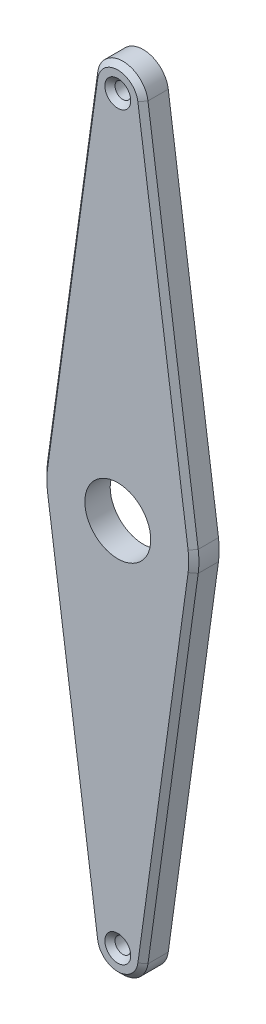
ISO-10303-21;
HEADER;
FILE_DESCRIPTION(('STEP AP214'),'2;1');
FILE_NAME('part.step','',(''),(''),'','','');
FILE_SCHEMA(('AUTOMOTIVE_DESIGN { 1 0 10303 214 1 1 1 1 }'));
ENDSEC;
DATA;
#1=APPLICATION_CONTEXT('core data for automotive mechanical design processes');
#2=APPLICATION_PROTOCOL_DEFINITION('international standard','automotive_design',2000,#1);
#3=PRODUCT_CONTEXT('',#1,'mechanical');
#4=PRODUCT('Part','Part','',(#3));
#5=PRODUCT_RELATED_PRODUCT_CATEGORY('part','',(#4));
#6=PRODUCT_DEFINITION_FORMATION('','',#4);
#7=PRODUCT_DEFINITION_CONTEXT('part definition',#1,'design');
#8=PRODUCT_DEFINITION('design','',#6,#7);
#9=PRODUCT_DEFINITION_SHAPE('','',#8);
#10=(LENGTH_UNIT() NAMED_UNIT(*) SI_UNIT(.MILLI.,.METRE.));
#11=(NAMED_UNIT(*) PLANE_ANGLE_UNIT() SI_UNIT($,.RADIAN.));
#12=(NAMED_UNIT(*) SI_UNIT($,.STERADIAN.) SOLID_ANGLE_UNIT());
#13=UNCERTAINTY_MEASURE_WITH_UNIT(LENGTH_MEASURE(1.E-05),#10,'distance_accuracy_value','');
#14=(GEOMETRIC_REPRESENTATION_CONTEXT(3) GLOBAL_UNCERTAINTY_ASSIGNED_CONTEXT((#13)) GLOBAL_UNIT_ASSIGNED_CONTEXT((#10,
#11,#12)) REPRESENTATION_CONTEXT('',''));
#15=CARTESIAN_POINT('',(0.,0.,0.));
#16=DIRECTION('',(0.,0.,1.));
#17=DIRECTION('',(1.,0.,0.));
#18=AXIS2_PLACEMENT_3D('',#15,#16,#17);
#19=CARTESIAN_POINT('',(0.,0.,5.));
#20=DIRECTION('',(0.,0.,1.));
#21=DIRECTION('',(1.,0.,0.));
#22=AXIS2_PLACEMENT_3D('',#19,#20,#21);
#23=PLANE('',#22);
#24=CARTESIAN_POINT('',(85.,68.,5.));
#25=DIRECTION('',(0.,0.,1.));
#26=DIRECTION('',(1.,0.,0.));
#27=AXIS2_PLACEMENT_3D('',#24,#25,#26);
#28=CIRCLE('',#27,6.5);
#29=CARTESIAN_POINT('',(91.5,68.,5.));
#30=VERTEX_POINT('',#29);
#31=EDGE_CURVE('E344',#30,#30,#28,.F.);
#32=ORIENTED_EDGE('',*,*,#31,.T.);
#33=EDGE_LOOP('',(#32));
#34=FACE_BOUND('',#33,.T.);
#35=CARTESIAN_POINT('',(85.,-5.,5.));
#36=DIRECTION('',(0.,0.,1.));
#37=DIRECTION('',(1.,0.,0.));
#38=AXIS2_PLACEMENT_3D('',#35,#36,#37);
#39=CIRCLE('',#38,2.55000000000002);
#40=CARTESIAN_POINT('',(87.55,-5.,5.));
#41=VERTEX_POINT('',#40);
#42=EDGE_CURVE('E43',#41,#41,#39,.F.);
#43=ORIENTED_EDGE('',*,*,#42,.T.);
#44=EDGE_LOOP('',(#43));
#45=FACE_BOUND('',#44,.T.);
#46=CARTESIAN_POINT('',(85.,68.,5.));
#47=DIRECTION('',(0.,0.,1.));
#48=DIRECTION('',(1.,0.,0.));
#49=AXIS2_PLACEMENT_3D('',#46,#47,#48);
#50=CIRCLE('',#49,14.);
#51=CARTESIAN_POINT('',(71.1319788133111,69.9178082191781,5.));
#52=VERTEX_POINT('',#51);
#53=CARTESIAN_POINT('',(71.1319788133111,66.0821917808219,5.));
#54=VERTEX_POINT('',#53);
#55=EDGE_CURVE('E197',#52,#54,#50,.T.);
#56=ORIENTED_EDGE('',*,*,#55,.T.);
#57=DIRECTION('',(0.136986301369863,-0.990572941906352,0.));
#58=VECTOR('',#57,1.);
#59=CARTESIAN_POINT('',(78.764187639776,10.8922970623549,5.));
#60=LINE('',#59,#58);
#61=CARTESIAN_POINT('',(81.0377082323746,-5.54794520547945,5.));
#62=VERTEX_POINT('',#61);
#63=EDGE_CURVE('E199',#54,#62,#60,.T.);
#64=ORIENTED_EDGE('',*,*,#63,.T.);
#65=CARTESIAN_POINT('',(85.,-5.,5.));
#66=DIRECTION('',(0.,0.,1.));
#67=DIRECTION('',(1.,0.,0.));
#68=AXIS2_PLACEMENT_3D('',#65,#66,#67);
#69=CIRCLE('',#68,3.99999999999996);
#70=CARTESIAN_POINT('',(88.9622917676253,-5.54794520547945,5.));
#71=VERTEX_POINT('',#70);
#72=EDGE_CURVE('E185',#62,#71,#69,.T.);
#73=ORIENTED_EDGE('',*,*,#72,.T.);
#74=DIRECTION('',(0.136986301369863,0.990572941906352,0.));
#75=VECTOR('',#74,1.);
#76=CARTESIAN_POINT('',(98.8680211866889,66.0821917808219,5.));
#77=LINE('',#76,#75);
#78=CARTESIAN_POINT('',(98.8680211866889,66.0821917808219,5.));
#79=VERTEX_POINT('',#78);
#80=EDGE_CURVE('E187',#71,#79,#77,.T.);
#81=ORIENTED_EDGE('',*,*,#80,.T.);
#82=CARTESIAN_POINT('',(85.,68.,5.));
#83=DIRECTION('',(0.,0.,1.));
#84=DIRECTION('',(1.,0.,0.));
#85=AXIS2_PLACEMENT_3D('',#82,#83,#84);
#86=CIRCLE('',#85,14.);
#87=CARTESIAN_POINT('',(98.8680211866889,69.9178082191781,5.));
#88=VERTEX_POINT('',#87);
#89=EDGE_CURVE('E189',#79,#88,#86,.T.);
#90=ORIENTED_EDGE('',*,*,#89,.T.);
#91=DIRECTION('',(-0.136986301369863,0.990572941906352,0.));
#92=VECTOR('',#91,1.);
#93=CARTESIAN_POINT('',(106.500230013154,14.727913500711,5.));
#94=LINE('',#93,#92);
#95=CARTESIAN_POINT('',(88.9622917676254,141.547945205479,5.));
#96=VERTEX_POINT('',#95);
#97=EDGE_CURVE('E191',#88,#96,#94,.T.);
#98=ORIENTED_EDGE('',*,*,#97,.T.);
#99=CARTESIAN_POINT('',(85.,141.,5.));
#100=DIRECTION('',(0.,0.,1.));
#101=DIRECTION('',(1.,0.,0.));
#102=AXIS2_PLACEMENT_3D('',#99,#100,#101);
#103=CIRCLE('',#102,3.99999999999996);
#104=CARTESIAN_POINT('',(81.0377082323746,141.547945205479,5.));
#105=VERTEX_POINT('',#104);
#106=EDGE_CURVE('E193',#96,#105,#103,.T.);
#107=ORIENTED_EDGE('',*,*,#106,.T.);
#108=DIRECTION('',(-0.136986301369863,-0.990572941906352,0.));
#109=VECTOR('',#108,1.);
#110=CARTESIAN_POINT('',(71.1319788133111,69.9178082191781,5.));
#111=LINE('',#110,#109);
#112=EDGE_CURVE('E195',#105,#52,#111,.T.);
#113=ORIENTED_EDGE('',*,*,#112,.T.);
#114=EDGE_LOOP('',(#56,#64,#73,#81,#90,#98,#107,#113));
#115=FACE_BOUND('',#114,.T.);
#116=CARTESIAN_POINT('',(85.,141.,5.));
#117=DIRECTION('',(0.,0.,1.));
#118=DIRECTION('',(1.,0.,0.));
#119=AXIS2_PLACEMENT_3D('',#116,#117,#118);
#120=CIRCLE('',#119,2.55000000000004);
#121=CARTESIAN_POINT('',(87.55,141.,5.));
#122=VERTEX_POINT('',#121);
#123=EDGE_CURVE('E235',#122,#122,#120,.F.);
#124=ORIENTED_EDGE('',*,*,#123,.T.);
#125=EDGE_LOOP('',(#124));
#126=FACE_BOUND('',#125,.T.);
#127=ADVANCED_FACE('F35',(#34,#45,#115,#126),#23,.T.);
#128=CARTESIAN_POINT('',(0.,0.,0.));
#129=DIRECTION('',(0.,0.,1.));
#130=DIRECTION('',(1.,0.,0.));
#131=AXIS2_PLACEMENT_3D('',#128,#129,#130);
#132=PLANE('',#131);
#133=CARTESIAN_POINT('',(85.,68.,0.));
#134=DIRECTION('',(0.,0.,-1.));
#135=DIRECTION('',(-1.,0.,0.));
#136=AXIS2_PLACEMENT_3D('',#133,#134,#135);
#137=CIRCLE('',#136,6.5);
#138=CARTESIAN_POINT('',(78.5,68.,0.));
#139=VERTEX_POINT('',#138);
#140=EDGE_CURVE('E340',#139,#139,#137,.T.);
#141=ORIENTED_EDGE('',*,*,#140,.F.);
#142=EDGE_LOOP('',(#141));
#143=FACE_BOUND('',#142,.T.);
#144=CARTESIAN_POINT('',(85.,-5.,0.));
#145=DIRECTION('',(0.,0.,1.));
#146=DIRECTION('',(1.,0.,0.));
#147=AXIS2_PLACEMENT_3D('',#144,#145,#146);
#148=CIRCLE('',#147,4.99999999999999);
#149=CARTESIAN_POINT('',(89.9528647095317,-5.68493150684932,0.));
#150=VERTEX_POINT('',#149);
#151=CARTESIAN_POINT('',(80.0471352904682,-5.68493150684932,0.));
#152=VERTEX_POINT('',#151);
#153=EDGE_CURVE('E139',#150,#152,#148,.F.);
#154=ORIENTED_EDGE('',*,*,#153,.T.);
#155=DIRECTION('',(-0.136986301369863,0.990572941906352,0.));
#156=VECTOR('',#155,1.);
#157=CARTESIAN_POINT('',(77.7736146978696,10.755310760985,0.));
#158=LINE('',#157,#156);
#159=CARTESIAN_POINT('',(70.1414058714047,65.9452054794521,0.));
#160=VERTEX_POINT('',#159);
#161=EDGE_CURVE('E169',#152,#160,#158,.T.);
#162=ORIENTED_EDGE('',*,*,#161,.T.);
#163=CARTESIAN_POINT('',(85.,68.,0.));
#164=DIRECTION('',(0.,0.,1.));
#165=DIRECTION('',(1.,0.,0.));
#166=AXIS2_PLACEMENT_3D('',#163,#164,#165);
#167=CIRCLE('',#166,15.);
#168=CARTESIAN_POINT('',(70.1414058714047,70.054794520548,0.));
#169=VERTEX_POINT('',#168);
#170=EDGE_CURVE('E166',#169,#160,#167,.T.);
#171=ORIENTED_EDGE('',*,*,#170,.F.);
#172=DIRECTION('',(-0.136986301369863,-0.990572941906352,0.));
#173=VECTOR('',#172,1.);
#174=CARTESIAN_POINT('',(59.3191050952307,-8.2032372012177,0.));
#175=LINE('',#174,#173);
#176=CARTESIAN_POINT('',(80.0471352904682,141.684931506849,0.));
#177=VERTEX_POINT('',#176);
#178=EDGE_CURVE('E163',#177,#169,#175,.T.);
#179=ORIENTED_EDGE('',*,*,#178,.F.);
#180=CARTESIAN_POINT('',(85.,141.,0.));
#181=DIRECTION('',(0.,0.,1.));
#182=DIRECTION('',(1.,0.,0.));
#183=AXIS2_PLACEMENT_3D('',#180,#181,#182);
#184=CIRCLE('',#183,4.99999999999999);
#185=CARTESIAN_POINT('',(89.9528647095317,141.684931506849,0.));
#186=VERTEX_POINT('',#185);
#187=EDGE_CURVE('E160',#186,#177,#184,.T.);
#188=ORIENTED_EDGE('',*,*,#187,.F.);
#189=DIRECTION('',(0.136986301369863,-0.990572941906352,0.));
#190=VECTOR('',#189,1.);
#191=CARTESIAN_POINT('',(107.49080295506,14.8648998020809,0.));
#192=LINE('',#191,#190);
#193=CARTESIAN_POINT('',(99.8585941285953,70.0547945205479,0.));
#194=VERTEX_POINT('',#193);
#195=EDGE_CURVE('E158',#186,#194,#192,.T.);
#196=ORIENTED_EDGE('',*,*,#195,.T.);
#197=CARTESIAN_POINT('',(85.,68.,0.));
#198=DIRECTION('',(0.,0.,1.));
#199=DIRECTION('',(1.,0.,0.));
#200=AXIS2_PLACEMENT_3D('',#197,#198,#199);
#201=CIRCLE('',#200,15.);
#202=CARTESIAN_POINT('',(99.8585941285952,65.9452054794521,0.));
#203=VERTEX_POINT('',#202);
#204=EDGE_CURVE('E143',#203,#194,#201,.T.);
#205=ORIENTED_EDGE('',*,*,#204,.F.);
#206=DIRECTION('',(0.136986301369863,0.990572941906352,0.));
#207=VECTOR('',#206,1.);
#208=CARTESIAN_POINT('',(89.0362933524212,-12.3128262423136,0.));
#209=LINE('',#208,#207);
#210=EDGE_CURVE('E126',#150,#203,#209,.T.);
#211=ORIENTED_EDGE('',*,*,#210,.F.);
#212=EDGE_LOOP('',(#154,#162,#171,#179,#188,#196,#205,#211));
#213=FACE_BOUND('',#212,.T.);
#214=CARTESIAN_POINT('',(85.,141.,0.));
#215=DIRECTION('',(0.,0.,1.));
#216=DIRECTION('',(1.,0.,0.));
#217=AXIS2_PLACEMENT_3D('',#214,#215,#216);
#218=CIRCLE('',#217,1.55000000000001);
#219=CARTESIAN_POINT('',(86.55,141.,0.));
#220=VERTEX_POINT('',#219);
#221=EDGE_CURVE('E154',#220,#220,#218,.F.);
#222=ORIENTED_EDGE('',*,*,#221,.F.);
#223=EDGE_LOOP('',(#222));
#224=FACE_BOUND('',#223,.T.);
#225=CARTESIAN_POINT('',(85.,-5.,0.));
#226=DIRECTION('',(0.,0.,1.));
#227=DIRECTION('',(1.,0.,0.));
#228=AXIS2_PLACEMENT_3D('',#225,#226,#227);
#229=CIRCLE('',#228,1.55000000000001);
#230=CARTESIAN_POINT('',(86.55,-5.,0.));
#231=VERTEX_POINT('',#230);
#232=EDGE_CURVE('E338',#231,#231,#229,.T.);
#233=ORIENTED_EDGE('',*,*,#232,.T.);
#234=EDGE_LOOP('',(#233));
#235=FACE_BOUND('',#234,.T.);
#236=ADVANCED_FACE('F136',(#143,#213,#224,#235),#132,.F.);
#237=CARTESIAN_POINT('',(85.,-5.,5.));
#238=DIRECTION('',(0.,0.,-1.));
#239=DIRECTION('',(-1.,0.,0.));
#240=AXIS2_PLACEMENT_3D('',#237,#238,#239);
#241=CYLINDRICAL_SURFACE('',#240,4.99999999999999);
#242=DIRECTION('',(0.,0.,-1.));
#243=VECTOR('',#242,1.);
#244=CARTESIAN_POINT('',(89.9528647095317,-5.68493150684932,5.));
#245=LINE('',#244,#243);
#246=CARTESIAN_POINT('',(89.9528647095317,-5.68493150684932,3.99999999999997));
#247=VERTEX_POINT('',#246);
#248=EDGE_CURVE('E123',#247,#150,#245,.T.);
#249=ORIENTED_EDGE('',*,*,#248,.F.);
#250=CARTESIAN_POINT('',(85.,-5.,3.99999999999997));
#251=DIRECTION('',(0.,0.,1.));
#252=DIRECTION('',(1.,0.,0.));
#253=AXIS2_PLACEMENT_3D('',#250,#251,#252);
#254=CIRCLE('',#253,4.99999999999999);
#255=CARTESIAN_POINT('',(80.0471352904682,-5.68493150684932,3.99999999999997));
#256=VERTEX_POINT('',#255);
#257=EDGE_CURVE('E212',#247,#256,#254,.F.);
#258=ORIENTED_EDGE('',*,*,#257,.T.);
#259=DIRECTION('',(0.,0.,-1.));
#260=VECTOR('',#259,1.);
#261=CARTESIAN_POINT('',(80.0471352904682,-5.68493150684932,5.));
#262=LINE('',#261,#260);
#263=EDGE_CURVE('E147',#256,#152,#262,.T.);
#264=ORIENTED_EDGE('',*,*,#263,.T.);
#265=ORIENTED_EDGE('',*,*,#153,.F.);
#266=EDGE_LOOP('',(#249,#258,#264,#265));
#267=FACE_BOUND('',#266,.T.);
#268=ADVANCED_FACE('F145',(#267),#241,.T.);
#269=CARTESIAN_POINT('',(89.0362933524212,-12.3128262423136,5.));
#270=DIRECTION('',(-0.990572941906352,0.136986301369863,0.));
#271=DIRECTION('',(-0.136986301369863,-0.990572941906352,0.));
#272=AXIS2_PLACEMENT_3D('',#269,#270,#271);
#273=PLANE('',#272);
#274=DIRECTION('',(0.,0.,-1.));
#275=VECTOR('',#274,1.);
#276=CARTESIAN_POINT('',(99.8585941285952,65.9452054794521,5.));
#277=LINE('',#276,#275);
#278=CARTESIAN_POINT('',(99.8585941285952,65.9452054794521,3.99999999999997));
#279=VERTEX_POINT('',#278);
#280=EDGE_CURVE('E132',#279,#203,#277,.T.);
#281=ORIENTED_EDGE('',*,*,#280,.F.);
#282=DIRECTION('',(-0.136986301369863,-0.990572941906352,0.));
#283=VECTOR('',#282,1.);
#284=CARTESIAN_POINT('',(89.9528647095317,-5.68493150684932,3.99999999999997));
#285=LINE('',#284,#283);
#286=EDGE_CURVE('E50',#279,#247,#285,.T.);
#287=ORIENTED_EDGE('',*,*,#286,.T.);
#288=ORIENTED_EDGE('',*,*,#248,.T.);
#289=ORIENTED_EDGE('',*,*,#210,.T.);
#290=EDGE_LOOP('',(#281,#287,#288,#289));
#291=FACE_BOUND('',#290,.T.);
#292=ADVANCED_FACE('F125',(#291),#273,.F.);
#293=CARTESIAN_POINT('',(85.,68.,5.));
#294=DIRECTION('',(0.,0.,-1.));
#295=DIRECTION('',(-1.,0.,0.));
#296=AXIS2_PLACEMENT_3D('',#293,#294,#295);
#297=CYLINDRICAL_SURFACE('',#296,15.);
#298=DIRECTION('',(0.,0.,-1.));
#299=VECTOR('',#298,1.);
#300=CARTESIAN_POINT('',(99.8585941285953,70.0547945205479,5.));
#301=LINE('',#300,#299);
#302=CARTESIAN_POINT('',(99.8585941285953,70.0547945205479,3.99999999999997));
#303=VERTEX_POINT('',#302);
#304=EDGE_CURVE('E180',#303,#194,#301,.T.);
#305=ORIENTED_EDGE('',*,*,#304,.F.);
#306=CARTESIAN_POINT('',(85.,68.,3.99999999999997));
#307=DIRECTION('',(0.,0.,1.));
#308=DIRECTION('',(1.,0.,0.));
#309=AXIS2_PLACEMENT_3D('',#306,#307,#308);
#310=CIRCLE('',#309,15.);
#311=EDGE_CURVE('E58',#303,#279,#310,.F.);
#312=ORIENTED_EDGE('',*,*,#311,.T.);
#313=ORIENTED_EDGE('',*,*,#280,.T.);
#314=ORIENTED_EDGE('',*,*,#204,.T.);
#315=EDGE_LOOP('',(#305,#312,#313,#314));
#316=FACE_BOUND('',#315,.T.);
#317=ADVANCED_FACE('F288',(#316),#297,.T.);
#318=CARTESIAN_POINT('',(107.49080295506,14.8648998020809,5.));
#319=DIRECTION('',(0.990572941906352,0.136986301369863,0.));
#320=DIRECTION('',(-0.136986301369863,0.990572941906352,0.));
#321=AXIS2_PLACEMENT_3D('',#318,#319,#320);
#322=PLANE('',#321);
#323=DIRECTION('',(0.,0.,-1.));
#324=VECTOR('',#323,1.);
#325=CARTESIAN_POINT('',(89.9528647095317,141.684931506849,5.));
#326=LINE('',#325,#324);
#327=CARTESIAN_POINT('',(89.9528647095317,141.684931506849,3.99999999999997));
#328=VERTEX_POINT('',#327);
#329=EDGE_CURVE('E178',#328,#186,#326,.T.);
#330=ORIENTED_EDGE('',*,*,#329,.F.);
#331=DIRECTION('',(0.136986301369863,-0.990572941906352,0.));
#332=VECTOR('',#331,1.);
#333=CARTESIAN_POINT('',(107.49080295506,14.8648998020809,3.99999999999997));
#334=LINE('',#333,#332);
#335=EDGE_CURVE('E208',#328,#303,#334,.T.);
#336=ORIENTED_EDGE('',*,*,#335,.T.);
#337=ORIENTED_EDGE('',*,*,#304,.T.);
#338=ORIENTED_EDGE('',*,*,#195,.F.);
#339=EDGE_LOOP('',(#330,#336,#337,#338));
#340=FACE_BOUND('',#339,.T.);
#341=ADVANCED_FACE('F284',(#340),#322,.T.);
#342=CARTESIAN_POINT('',(85.,141.,5.));
#343=DIRECTION('',(0.,0.,-1.));
#344=DIRECTION('',(-1.,0.,0.));
#345=AXIS2_PLACEMENT_3D('',#342,#343,#344);
#346=CYLINDRICAL_SURFACE('',#345,4.99999999999999);
#347=DIRECTION('',(0.,0.,-1.));
#348=VECTOR('',#347,1.);
#349=CARTESIAN_POINT('',(80.0471352904682,141.684931506849,5.));
#350=LINE('',#349,#348);
#351=CARTESIAN_POINT('',(80.0471352904682,141.684931506849,3.99999999999997));
#352=VERTEX_POINT('',#351);
#353=EDGE_CURVE('E176',#352,#177,#350,.T.);
#354=ORIENTED_EDGE('',*,*,#353,.F.);
#355=CARTESIAN_POINT('',(85.,141.,3.99999999999997));
#356=DIRECTION('',(0.,0.,1.));
#357=DIRECTION('',(1.,0.,0.));
#358=AXIS2_PLACEMENT_3D('',#355,#356,#357);
#359=CIRCLE('',#358,4.99999999999999);
#360=EDGE_CURVE('E206',#352,#328,#359,.F.);
#361=ORIENTED_EDGE('',*,*,#360,.T.);
#362=ORIENTED_EDGE('',*,*,#329,.T.);
#363=ORIENTED_EDGE('',*,*,#187,.T.);
#364=EDGE_LOOP('',(#354,#361,#362,#363));
#365=FACE_BOUND('',#364,.T.);
#366=ADVANCED_FACE('F280',(#365),#346,.T.);
#367=CARTESIAN_POINT('',(59.3191050952307,-8.2032372012177,5.));
#368=DIRECTION('',(0.990572941906352,-0.136986301369863,0.));
#369=DIRECTION('',(0.136986301369863,0.990572941906352,0.));
#370=AXIS2_PLACEMENT_3D('',#367,#368,#369);
#371=PLANE('',#370);
#372=DIRECTION('',(0.,0.,-1.));
#373=VECTOR('',#372,1.);
#374=CARTESIAN_POINT('',(70.1414058714047,70.054794520548,5.));
#375=LINE('',#374,#373);
#376=CARTESIAN_POINT('',(70.1414058714047,70.054794520548,3.99999999999997));
#377=VERTEX_POINT('',#376);
#378=EDGE_CURVE('E174',#377,#169,#375,.T.);
#379=ORIENTED_EDGE('',*,*,#378,.F.);
#380=DIRECTION('',(0.136986301369863,0.990572941906352,0.));
#381=VECTOR('',#380,1.);
#382=CARTESIAN_POINT('',(80.0471352904682,141.684931506849,3.99999999999997));
#383=LINE('',#382,#381);
#384=EDGE_CURVE('E204',#377,#352,#383,.T.);
#385=ORIENTED_EDGE('',*,*,#384,.T.);
#386=ORIENTED_EDGE('',*,*,#353,.T.);
#387=ORIENTED_EDGE('',*,*,#178,.T.);
#388=EDGE_LOOP('',(#379,#385,#386,#387));
#389=FACE_BOUND('',#388,.T.);
#390=ADVANCED_FACE('F276',(#389),#371,.F.);
#391=CARTESIAN_POINT('',(85.,68.,5.));
#392=DIRECTION('',(0.,0.,-1.));
#393=DIRECTION('',(-1.,0.,0.));
#394=AXIS2_PLACEMENT_3D('',#391,#392,#393);
#395=CYLINDRICAL_SURFACE('',#394,15.);
#396=DIRECTION('',(0.,0.,-1.));
#397=VECTOR('',#396,1.);
#398=CARTESIAN_POINT('',(70.1414058714047,65.9452054794521,5.));
#399=LINE('',#398,#397);
#400=CARTESIAN_POINT('',(70.1414058714047,65.9452054794521,3.99999999999997));
#401=VERTEX_POINT('',#400);
#402=EDGE_CURVE('E172',#401,#160,#399,.T.);
#403=ORIENTED_EDGE('',*,*,#402,.F.);
#404=CARTESIAN_POINT('',(85.,68.,3.99999999999997));
#405=DIRECTION('',(0.,0.,1.));
#406=DIRECTION('',(1.,0.,0.));
#407=AXIS2_PLACEMENT_3D('',#404,#405,#406);
#408=CIRCLE('',#407,15.);
#409=EDGE_CURVE('E202',#401,#377,#408,.F.);
#410=ORIENTED_EDGE('',*,*,#409,.T.);
#411=ORIENTED_EDGE('',*,*,#378,.T.);
#412=ORIENTED_EDGE('',*,*,#170,.T.);
#413=EDGE_LOOP('',(#403,#410,#411,#412));
#414=FACE_BOUND('',#413,.T.);
#415=ADVANCED_FACE('F272',(#414),#395,.T.);
#416=CARTESIAN_POINT('',(77.7736146978696,10.755310760985,5.));
#417=DIRECTION('',(-0.990572941906352,-0.136986301369863,0.));
#418=DIRECTION('',(0.136986301369863,-0.990572941906352,0.));
#419=AXIS2_PLACEMENT_3D('',#416,#417,#418);
#420=PLANE('',#419);
#421=ORIENTED_EDGE('',*,*,#263,.F.);
#422=DIRECTION('',(-0.136986301369863,0.990572941906352,0.));
#423=VECTOR('',#422,1.);
#424=CARTESIAN_POINT('',(77.7736146978696,10.755310760985,3.99999999999998));
#425=LINE('',#424,#423);
#426=EDGE_CURVE('E131',#256,#401,#425,.T.);
#427=ORIENTED_EDGE('',*,*,#426,.T.);
#428=ORIENTED_EDGE('',*,*,#402,.T.);
#429=ORIENTED_EDGE('',*,*,#161,.F.);
#430=EDGE_LOOP('',(#421,#427,#428,#429));
#431=FACE_BOUND('',#430,.T.);
#432=ADVANCED_FACE('F268',(#431),#420,.T.);
#433=CARTESIAN_POINT('',(107.49080295506,14.8648998020809,3.99999999999997));
#434=DIRECTION('',(-0.700440844481893,-0.0968639426282947,-0.707106781186544));
#435=DIRECTION('',(0.136986301369863,-0.990572941906352,0.));
#436=AXIS2_PLACEMENT_3D('',#433,#434,#435);
#437=PLANE('',#436);
#438=DIRECTION('',(0.700440844481885,0.0968639426283034,-0.707106781186551));
#439=VECTOR('',#438,1.);
#440=CARTESIAN_POINT('',(88.9622917676254,141.547945205479,5.));
#441=LINE('',#440,#439);
#442=EDGE_CURVE('E151',#96,#328,#441,.T.);
#443=ORIENTED_EDGE('',*,*,#442,.F.);
#444=ORIENTED_EDGE('',*,*,#97,.F.);
#445=DIRECTION('',(-0.700440844481885,-0.0968639426282937,0.707106781186551));
#446=VECTOR('',#445,1.);
#447=CARTESIAN_POINT('',(99.8585941285953,70.0547945205479,3.99999999999997));
#448=LINE('',#447,#446);
#449=EDGE_CURVE('E148',#303,#88,#448,.T.);
#450=ORIENTED_EDGE('',*,*,#449,.F.);
#451=ORIENTED_EDGE('',*,*,#335,.F.);
#452=EDGE_LOOP('',(#443,#444,#450,#451));
#453=FACE_BOUND('',#452,.T.);
#454=ADVANCED_FACE('F271',(#453),#437,.F.);
#455=CARTESIAN_POINT('',(85.,68.,5.));
#456=DIRECTION('',(0.,0.,-1.));
#457=DIRECTION('',(-1.,0.,0.));
#458=AXIS2_PLACEMENT_3D('',#455,#456,#457);
#459=CONICAL_SURFACE('',#458,14.,0.785398163397446);
#460=ORIENTED_EDGE('',*,*,#449,.T.);
#461=ORIENTED_EDGE('',*,*,#89,.F.);
#462=DIRECTION('',(-0.700440844481886,0.0968639426282937,0.707106781186551));
#463=VECTOR('',#462,1.);
#464=CARTESIAN_POINT('',(99.8585941285953,65.9452054794521,3.99999999999997));
#465=LINE('',#464,#463);
#466=EDGE_CURVE('E228',#279,#79,#465,.T.);
#467=ORIENTED_EDGE('',*,*,#466,.F.);
#468=ORIENTED_EDGE('',*,*,#311,.F.);
#469=EDGE_LOOP('',(#460,#461,#467,#468));
#470=FACE_BOUND('',#469,.T.);
#471=ADVANCED_FACE('F319',(#470),#459,.T.);
#472=CARTESIAN_POINT('',(85.,141.,5.));
#473=DIRECTION('',(0.,0.,-1.));
#474=DIRECTION('',(-1.,0.,0.));
#475=AXIS2_PLACEMENT_3D('',#472,#473,#474);
#476=CONICAL_SURFACE('',#475,3.99999999999996,0.78539816339745);
#477=ORIENTED_EDGE('',*,*,#442,.T.);
#478=ORIENTED_EDGE('',*,*,#360,.F.);
#479=DIRECTION('',(-0.70044084448189,0.0968639426283028,-0.707106781186546));
#480=VECTOR('',#479,1.);
#481=CARTESIAN_POINT('',(81.0377082323746,141.547945205479,5.));
#482=LINE('',#481,#480);
#483=EDGE_CURVE('E225',#105,#352,#482,.T.);
#484=ORIENTED_EDGE('',*,*,#483,.F.);
#485=ORIENTED_EDGE('',*,*,#106,.F.);
#486=EDGE_LOOP('',(#477,#478,#484,#485));
#487=FACE_BOUND('',#486,.T.);
#488=ADVANCED_FACE('F315',(#487),#476,.T.);
#489=CARTESIAN_POINT('',(88.0457204105148,-12.1758399409437,5.));
#490=DIRECTION('',(0.700440844481888,-0.096863942628294,0.707106781186549));
#491=DIRECTION('',(-0.136986301369863,-0.990572941906352,0.));
#492=AXIS2_PLACEMENT_3D('',#489,#490,#491);
#493=PLANE('',#492);
#494=ORIENTED_EDGE('',*,*,#466,.T.);
#495=ORIENTED_EDGE('',*,*,#80,.F.);
#496=DIRECTION('',(-0.700440844481891,0.0968639426282949,0.707106781186546));
#497=VECTOR('',#496,1.);
#498=CARTESIAN_POINT('',(89.9528647095317,-5.68493150684932,3.99999999999997));
#499=LINE('',#498,#497);
#500=EDGE_CURVE('E222',#247,#71,#499,.T.);
#501=ORIENTED_EDGE('',*,*,#500,.F.);
#502=ORIENTED_EDGE('',*,*,#286,.F.);
#503=EDGE_LOOP('',(#494,#495,#501,#502));
#504=FACE_BOUND('',#503,.T.);
#505=ADVANCED_FACE('F311',(#504),#493,.T.);
#506=CARTESIAN_POINT('',(60.3096780371371,-8.34022350258757,5.));
#507=DIRECTION('',(-0.700440844481888,0.096863942628294,0.707106781186549));
#508=DIRECTION('',(0.136986301369863,0.990572941906352,0.));
#509=AXIS2_PLACEMENT_3D('',#506,#507,#508);
#510=PLANE('',#509);
#511=ORIENTED_EDGE('',*,*,#483,.T.);
#512=ORIENTED_EDGE('',*,*,#384,.F.);
#513=DIRECTION('',(-0.700440844481891,0.0968639426282931,-0.707106781186546));
#514=VECTOR('',#513,1.);
#515=CARTESIAN_POINT('',(71.1319788133111,69.9178082191781,5.));
#516=LINE('',#515,#514);
#517=EDGE_CURVE('E219',#52,#377,#516,.T.);
#518=ORIENTED_EDGE('',*,*,#517,.F.);
#519=ORIENTED_EDGE('',*,*,#112,.F.);
#520=EDGE_LOOP('',(#511,#512,#518,#519));
#521=FACE_BOUND('',#520,.T.);
#522=ADVANCED_FACE('F307',(#521),#510,.T.);
#523=CARTESIAN_POINT('',(85.,-5.,3.99999999999997));
#524=DIRECTION('',(0.,0.,-1.));
#525=DIRECTION('',(-1.,0.,0.));
#526=AXIS2_PLACEMENT_3D('',#523,#524,#525);
#527=CONICAL_SURFACE('',#526,4.99999999999999,0.785398163397449);
#528=ORIENTED_EDGE('',*,*,#500,.T.);
#529=ORIENTED_EDGE('',*,*,#72,.F.);
#530=DIRECTION('',(0.700440844481891,0.0968639426282943,0.707106781186546));
#531=VECTOR('',#530,1.);
#532=CARTESIAN_POINT('',(80.0471352904682,-5.68493150684932,3.99999999999997));
#533=LINE('',#532,#531);
#534=EDGE_CURVE('E217',#256,#62,#533,.T.);
#535=ORIENTED_EDGE('',*,*,#534,.F.);
#536=ORIENTED_EDGE('',*,*,#257,.F.);
#537=EDGE_LOOP('',(#528,#529,#535,#536));
#538=FACE_BOUND('',#537,.T.);
#539=ADVANCED_FACE('F303',(#538),#527,.T.);
#540=CARTESIAN_POINT('',(85.,68.,5.));
#541=DIRECTION('',(0.,0.,-1.));
#542=DIRECTION('',(-1.,0.,0.));
#543=AXIS2_PLACEMENT_3D('',#540,#541,#542);
#544=CONICAL_SURFACE('',#543,14.,0.78539816339745);
#545=ORIENTED_EDGE('',*,*,#517,.T.);
#546=ORIENTED_EDGE('',*,*,#409,.F.);
#547=DIRECTION('',(-0.700440844481891,-0.0968639426282931,-0.707106781186546));
#548=VECTOR('',#547,1.);
#549=CARTESIAN_POINT('',(71.1319788133111,66.0821917808219,5.));
#550=LINE('',#549,#548);
#551=EDGE_CURVE('E215',#54,#401,#550,.T.);
#552=ORIENTED_EDGE('',*,*,#551,.F.);
#553=ORIENTED_EDGE('',*,*,#55,.F.);
#554=EDGE_LOOP('',(#545,#546,#552,#553));
#555=FACE_BOUND('',#554,.T.);
#556=ADVANCED_FACE('F299',(#555),#544,.T.);
#557=CARTESIAN_POINT('',(77.7736146978696,10.755310760985,3.99999999999997));
#558=DIRECTION('',(0.700440844481883,0.0968639426282933,-0.707106781186554));
#559=DIRECTION('',(-0.136986301369863,0.990572941906352,0.));
#560=AXIS2_PLACEMENT_3D('',#557,#558,#559);
#561=PLANE('',#560);
#562=ORIENTED_EDGE('',*,*,#534,.T.);
#563=ORIENTED_EDGE('',*,*,#63,.F.);
#564=ORIENTED_EDGE('',*,*,#551,.T.);
#565=ORIENTED_EDGE('',*,*,#426,.F.);
#566=EDGE_LOOP('',(#562,#563,#564,#565));
#567=FACE_BOUND('',#566,.T.);
#568=ADVANCED_FACE('F296',(#567),#561,.F.);
#569=CARTESIAN_POINT('',(85.,141.,-0.00100000000000013));
#570=DIRECTION('',(0.,0.,1.));
#571=DIRECTION('',(1.,0.,0.));
#572=AXIS2_PLACEMENT_3D('',#569,#570,#571);
#573=CYLINDRICAL_SURFACE('',#572,1.55000000000001);
#574=CARTESIAN_POINT('',(85.,141.,3.99999999999998));
#575=DIRECTION('',(0.,0.,1.));
#576=DIRECTION('',(1.,0.,0.));
#577=AXIS2_PLACEMENT_3D('',#574,#575,#576);
#578=CIRCLE('',#577,1.55000000000001);
#579=CARTESIAN_POINT('',(86.55,141.,3.99999999999998));
#580=VERTEX_POINT('',#579);
#581=EDGE_CURVE('E214',#580,#580,#578,.T.);
#582=ORIENTED_EDGE('',*,*,#581,.T.);
#583=EDGE_LOOP('',(#582));
#584=FACE_BOUND('',#583,.T.);
#585=ORIENTED_EDGE('',*,*,#221,.T.);
#586=EDGE_LOOP('',(#585));
#587=FACE_BOUND('',#586,.T.);
#588=ADVANCED_FACE('F266',(#584,#587),#573,.F.);
#589=CARTESIAN_POINT('',(85.,141.,3.99999999999998));
#590=DIRECTION('',(0.,0.,1.));
#591=DIRECTION('',(1.,0.,0.));
#592=AXIS2_PLACEMENT_3D('',#589,#590,#591);
#593=CONICAL_SURFACE('',#592,1.55000000000001,0.785398163397452);
#594=ORIENTED_EDGE('',*,*,#123,.F.);
#595=EDGE_LOOP('',(#594));
#596=FACE_BOUND('',#595,.T.);
#597=ORIENTED_EDGE('',*,*,#581,.F.);
#598=EDGE_LOOP('',(#597));
#599=FACE_BOUND('',#598,.T.);
#600=ADVANCED_FACE('F252',(#596,#599),#593,.F.);
#601=CARTESIAN_POINT('',(85.,-5.,-0.00100000000000013));
#602=DIRECTION('',(0.,0.,1.));
#603=DIRECTION('',(1.,0.,0.));
#604=AXIS2_PLACEMENT_3D('',#601,#602,#603);
#605=CYLINDRICAL_SURFACE('',#604,1.55000000000001);
#606=CARTESIAN_POINT('',(85.,-5.,3.99999999999999));
#607=DIRECTION('',(0.,0.,1.));
#608=DIRECTION('',(1.,0.,0.));
#609=AXIS2_PLACEMENT_3D('',#606,#607,#608);
#610=CIRCLE('',#609,1.55000000000001);
#611=CARTESIAN_POINT('',(86.55,-5.,3.99999999999999));
#612=VERTEX_POINT('',#611);
#613=EDGE_CURVE('E11',#612,#612,#610,.T.);
#614=ORIENTED_EDGE('',*,*,#613,.T.);
#615=EDGE_LOOP('',(#614));
#616=FACE_BOUND('',#615,.T.);
#617=ORIENTED_EDGE('',*,*,#232,.F.);
#618=EDGE_LOOP('',(#617));
#619=FACE_BOUND('',#618,.T.);
#620=ADVANCED_FACE('F244',(#616,#619),#605,.F.);
#621=CARTESIAN_POINT('',(85.,-5.,5.));
#622=DIRECTION('',(0.,0.,1.));
#623=DIRECTION('',(1.,0.,0.));
#624=AXIS2_PLACEMENT_3D('',#621,#622,#623);
#625=CONICAL_SURFACE('',#624,2.55000000000002,0.785398163397454);
#626=ORIENTED_EDGE('',*,*,#613,.F.);
#627=EDGE_LOOP('',(#626));
#628=FACE_BOUND('',#627,.T.);
#629=ORIENTED_EDGE('',*,*,#42,.F.);
#630=EDGE_LOOP('',(#629));
#631=FACE_BOUND('',#630,.T.);
#632=ADVANCED_FACE('F37',(#628,#631),#625,.F.);
#633=CARTESIAN_POINT('',(85.,68.,5.001));
#634=DIRECTION('',(0.,0.,-1.));
#635=DIRECTION('',(-1.,0.,0.));
#636=AXIS2_PLACEMENT_3D('',#633,#634,#635);
#637=CYLINDRICAL_SURFACE('',#636,6.5);
#638=ORIENTED_EDGE('',*,*,#31,.F.);
#639=EDGE_LOOP('',(#638));
#640=FACE_BOUND('',#639,.T.);
#641=ORIENTED_EDGE('',*,*,#140,.T.);
#642=EDGE_LOOP('',(#641));
#643=FACE_BOUND('',#642,.T.);
#644=ADVANCED_FACE('F243',(#640,#643),#637,.F.);
#645=CLOSED_SHELL('',(#127,#236,#268,#292,#317,#341,#366,#390,#415,#432,#454,#471,#488,#505,
#522,#539,#556,#568,#588,#600,#620,#632,#644));
#646=MANIFOLD_SOLID_BREP('B2',#645);
#647=ADVANCED_BREP_SHAPE_REPRESENTATION('',(#18,#646),#14);
#648=SHAPE_DEFINITION_REPRESENTATION(#9,#647);
ENDSEC;
END-ISO-10303-21;
